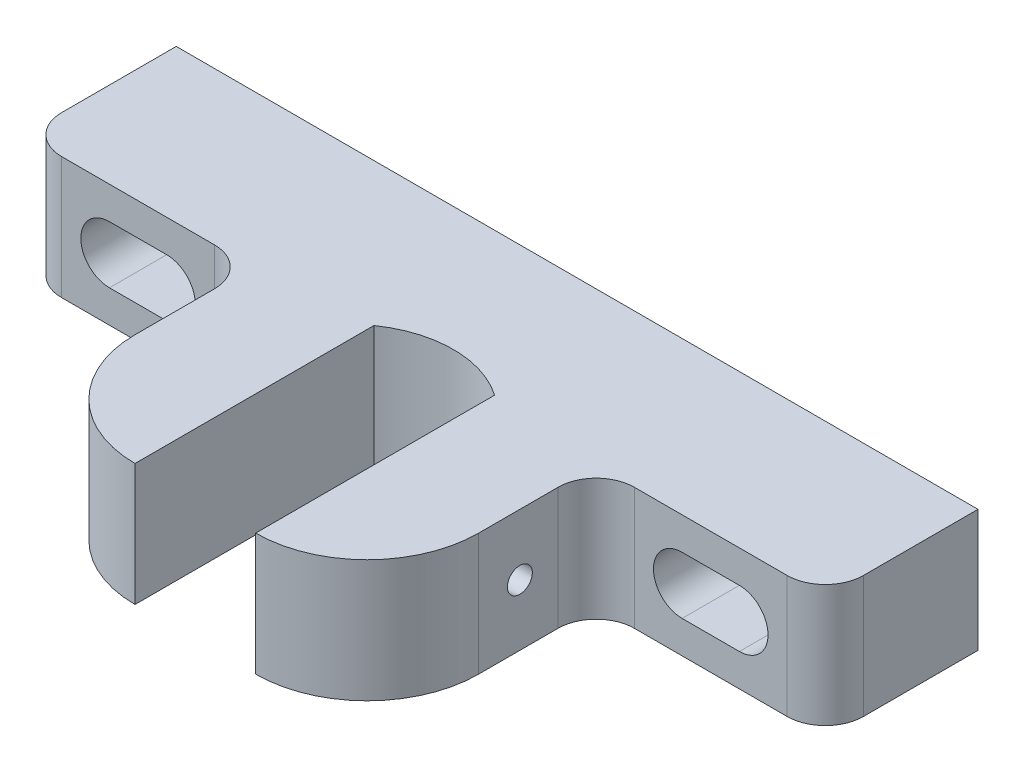
ISO-10303-21;
HEADER;
FILE_DESCRIPTION(('STEP AP214'),'2;1');
FILE_NAME('part.step','',(''),(''),'','','');
FILE_SCHEMA(('AUTOMOTIVE_DESIGN { 1 0 10303 214 1 1 1 1 }'));
ENDSEC;
DATA;
#1=APPLICATION_CONTEXT('core data for automotive mechanical design processes');
#2=APPLICATION_PROTOCOL_DEFINITION('international standard','automotive_design',2000,#1);
#3=PRODUCT_CONTEXT('',#1,'mechanical');
#4=PRODUCT('Part','Part','',(#3));
#5=PRODUCT_RELATED_PRODUCT_CATEGORY('part','',(#4));
#6=PRODUCT_DEFINITION_FORMATION('','',#4);
#7=PRODUCT_DEFINITION_CONTEXT('part definition',#1,'design');
#8=PRODUCT_DEFINITION('design','',#6,#7);
#9=PRODUCT_DEFINITION_SHAPE('','',#8);
#10=(LENGTH_UNIT() NAMED_UNIT(*) SI_UNIT(.MILLI.,.METRE.));
#11=(NAMED_UNIT(*) PLANE_ANGLE_UNIT() SI_UNIT($,.RADIAN.));
#12=(NAMED_UNIT(*) SI_UNIT($,.STERADIAN.) SOLID_ANGLE_UNIT());
#13=UNCERTAINTY_MEASURE_WITH_UNIT(LENGTH_MEASURE(1.E-05),#10,'distance_accuracy_value','');
#14=(GEOMETRIC_REPRESENTATION_CONTEXT(3) GLOBAL_UNCERTAINTY_ASSIGNED_CONTEXT((#13)) GLOBAL_UNIT_ASSIGNED_CONTEXT((#10,
#11,#12)) REPRESENTATION_CONTEXT('',''));
#15=CARTESIAN_POINT('',(0.,0.,0.));
#16=DIRECTION('',(0.,0.,1.));
#17=DIRECTION('',(1.,0.,0.));
#18=AXIS2_PLACEMENT_3D('',#15,#16,#17);
#19=CARTESIAN_POINT('',(28.5749999999999,24.2887500000001,44.958));
#20=DIRECTION('',(-1.,0.,0.));
#21=DIRECTION('',(0.,0.,1.));
#22=AXIS2_PLACEMENT_3D('',#19,#20,#21);
#23=PLANE('',#22);
#24=DIRECTION('',(0.,0.,-1.));
#25=VECTOR('',#24,1.);
#26=CARTESIAN_POINT('',(28.5749999999999,3.96875000000006,44.958));
#27=LINE('',#26,#25);
#28=CARTESIAN_POINT('',(28.5749999999999,3.96875000000006,44.958));
#29=VERTEX_POINT('',#28);
#30=CARTESIAN_POINT('',(28.5749999999999,3.96875000000006,31.75));
#31=VERTEX_POINT('',#30);
#32=EDGE_CURVE('E369',#29,#31,#27,.T.);
#33=ORIENTED_EDGE('',*,*,#32,.T.);
#34=DIRECTION('',(0.,-1.,0.));
#35=VECTOR('',#34,1.);
#36=CARTESIAN_POINT('',(28.5749999999999,24.2887500000001,31.75));
#37=LINE('',#36,#35);
#38=CARTESIAN_POINT('',(28.5749999999999,24.2887500000001,31.75));
#39=VERTEX_POINT('',#38);
#40=EDGE_CURVE('E419',#39,#31,#37,.T.);
#41=ORIENTED_EDGE('',*,*,#40,.F.);
#42=DIRECTION('',(0.,0.,-1.));
#43=VECTOR('',#42,1.);
#44=CARTESIAN_POINT('',(28.5749999999999,24.2887500000001,44.958));
#45=LINE('',#44,#43);
#46=CARTESIAN_POINT('',(28.5749999999999,24.2887500000001,44.958));
#47=VERTEX_POINT('',#46);
#48=EDGE_CURVE('E326',#47,#39,#45,.T.);
#49=ORIENTED_EDGE('',*,*,#48,.F.);
#50=DIRECTION('',(0.,-1.,0.));
#51=VECTOR('',#50,1.);
#52=CARTESIAN_POINT('',(28.5749999999999,24.2887500000001,44.958));
#53=LINE('',#52,#51);
#54=EDGE_CURVE('E422',#47,#29,#53,.T.);
#55=ORIENTED_EDGE('',*,*,#54,.T.);
#56=EDGE_LOOP('',(#33,#41,#49,#55));
#57=FACE_BOUND('',#56,.T.);
#58=CARTESIAN_POINT('',(28.5749999999999,14.1287500000001,38.1));
#59=DIRECTION('',(-1.,0.,0.));
#60=DIRECTION('',(0.,0.,1.));
#61=AXIS2_PLACEMENT_3D('',#58,#59,#60);
#62=CIRCLE('',#61,2.07645);
#63=CARTESIAN_POINT('',(28.5749999999999,14.1287500000001,40.17645));
#64=VERTEX_POINT('',#63);
#65=EDGE_CURVE('E726',#64,#64,#62,.F.);
#66=ORIENTED_EDGE('',*,*,#65,.F.);
#67=EDGE_LOOP('',(#66));
#68=FACE_BOUND('',#67,.T.);
#69=ADVANCED_FACE('F38',(#57,#68),#23,.F.);
#70=CARTESIAN_POINT('',(10.0329999999999,24.2887500000001,23.761628021285));
#71=DIRECTION('',(1.,0.,0.));
#72=DIRECTION('',(0.,0.,-1.));
#73=AXIS2_PLACEMENT_3D('',#70,#71,#72);
#74=PLANE('',#73);
#75=DIRECTION('',(0.,0.,1.));
#76=VECTOR('',#75,1.);
#77=CARTESIAN_POINT('',(10.0329999999999,3.96875000000006,23.761628021285));
#78=LINE('',#77,#76);
#79=CARTESIAN_POINT('',(10.0329999999999,3.96875000000006,23.761628021285));
#80=VERTEX_POINT('',#79);
#81=CARTESIAN_POINT('',(10.0329999999999,3.96875000000006,63.5));
#82=VERTEX_POINT('',#81);
#83=EDGE_CURVE('E361',#80,#82,#78,.T.);
#84=ORIENTED_EDGE('',*,*,#83,.T.);
#85=DIRECTION('',(0.,-1.,0.));
#86=VECTOR('',#85,1.);
#87=CARTESIAN_POINT('',(10.0329999999999,24.2887500000001,63.5));
#88=LINE('',#87,#86);
#89=CARTESIAN_POINT('',(10.0329999999999,24.2887500000001,63.5));
#90=VERTEX_POINT('',#89);
#91=EDGE_CURVE('E425',#90,#82,#88,.T.);
#92=ORIENTED_EDGE('',*,*,#91,.F.);
#93=DIRECTION('',(0.,0.,1.));
#94=VECTOR('',#93,1.);
#95=CARTESIAN_POINT('',(10.0329999999999,24.2887500000001,23.761628021285));
#96=LINE('',#95,#94);
#97=CARTESIAN_POINT('',(10.0329999999999,24.2887500000001,23.761628021285));
#98=VERTEX_POINT('',#97);
#99=EDGE_CURVE('E317',#98,#90,#96,.T.);
#100=ORIENTED_EDGE('',*,*,#99,.F.);
#101=DIRECTION('',(0.,-1.,0.));
#102=VECTOR('',#101,1.);
#103=CARTESIAN_POINT('',(10.0329999999999,24.2887500000001,23.761628021285));
#104=LINE('',#103,#102);
#105=EDGE_CURVE('E357',#98,#80,#104,.T.);
#106=ORIENTED_EDGE('',*,*,#105,.T.);
#107=EDGE_LOOP('',(#84,#92,#100,#106));
#108=FACE_BOUND('',#107,.T.);
#109=CARTESIAN_POINT('',(10.0329999999999,14.1287500000001,38.1));
#110=DIRECTION('',(1.,0.,0.));
#111=DIRECTION('',(0.,0.,-1.));
#112=AXIS2_PLACEMENT_3D('',#109,#110,#111);
#113=CIRCLE('',#112,2.07645);
#114=CARTESIAN_POINT('',(10.0329999999999,14.1287500000001,36.02355));
#115=VERTEX_POINT('',#114);
#116=EDGE_CURVE('E42',#115,#115,#113,.F.);
#117=ORIENTED_EDGE('',*,*,#116,.F.);
#118=EDGE_LOOP('',(#117));
#119=FACE_BOUND('',#118,.T.);
#120=ADVANCED_FACE('F528',(#108,#119),#74,.F.);
#121=CARTESIAN_POINT('',(-66.6749999999999,24.2887500000001,63.5));
#122=DIRECTION('',(1.,0.,0.));
#123=DIRECTION('',(0.,0.,-1.));
#124=AXIS2_PLACEMENT_3D('',#121,#122,#123);
#125=PLANE('',#124);
#126=DIRECTION('',(0.,0.,-1.));
#127=VECTOR('',#126,1.);
#128=CARTESIAN_POINT('',(-66.6749999999999,3.96875000000006,63.5));
#129=LINE('',#128,#127);
#130=CARTESIAN_POINT('',(-66.6749999999999,3.96875000000006,19.05));
#131=VERTEX_POINT('',#130);
#132=CARTESIAN_POINT('',(-66.6749999999999,3.96875000000006,0.));
#133=VERTEX_POINT('',#132);
#134=EDGE_CURVE('E454',#131,#133,#129,.T.);
#135=ORIENTED_EDGE('',*,*,#134,.F.);
#136=DIRECTION('',(0.,-1.,0.));
#137=VECTOR('',#136,1.);
#138=CARTESIAN_POINT('',(-66.6749999999999,24.2887500000001,19.05));
#139=LINE('',#138,#137);
#140=CARTESIAN_POINT('',(-66.6749999999999,24.2887500000001,19.05));
#141=VERTEX_POINT('',#140);
#142=EDGE_CURVE('E480',#131,#141,#139,.F.);
#143=ORIENTED_EDGE('',*,*,#142,.T.);
#144=DIRECTION('',(0.,0.,-1.));
#145=VECTOR('',#144,1.);
#146=CARTESIAN_POINT('',(-66.6749999999999,24.2887500000001,63.5));
#147=LINE('',#146,#145);
#148=CARTESIAN_POINT('',(-66.6749999999999,24.2887500000001,0.));
#149=VERTEX_POINT('',#148);
#150=EDGE_CURVE('E445',#141,#149,#147,.T.);
#151=ORIENTED_EDGE('',*,*,#150,.T.);
#152=DIRECTION('',(0.,-1.,0.));
#153=VECTOR('',#152,1.);
#154=CARTESIAN_POINT('',(-66.6749999999999,24.2887500000001,0.));
#155=LINE('',#154,#153);
#156=EDGE_CURVE('E402',#149,#133,#155,.T.);
#157=ORIENTED_EDGE('',*,*,#156,.T.);
#158=EDGE_LOOP('',(#135,#143,#151,#157));
#159=FACE_BOUND('',#158,.T.);
#160=ADVANCED_FACE('F534',(#159),#125,.F.);
#161=CARTESIAN_POINT('',(-66.6749999999999,3.96875000000006,63.5));
#162=DIRECTION('',(0.,1.,0.));
#163=DIRECTION('',(0.,0.,1.));
#164=AXIS2_PLACEMENT_3D('',#161,#162,#163);
#165=PLANE('',#164);
#166=DIRECTION('',(0.,0.,-1.));
#167=VECTOR('',#166,1.);
#168=CARTESIAN_POINT('',(66.6750000000001,3.96875000000006,63.5));
#169=LINE('',#168,#167);
#170=CARTESIAN_POINT('',(66.6750000000001,3.96875000000006,19.05));
#171=VERTEX_POINT('',#170);
#172=CARTESIAN_POINT('',(66.6750000000001,3.96875000000006,0.));
#173=VERTEX_POINT('',#172);
#174=EDGE_CURVE('E451',#171,#173,#169,.T.);
#175=ORIENTED_EDGE('',*,*,#174,.F.);
#176=CARTESIAN_POINT('',(60.3250000000001,3.96875000000006,19.05));
#177=DIRECTION('',(0.,1.,0.));
#178=DIRECTION('',(0.,0.,1.));
#179=AXIS2_PLACEMENT_3D('',#176,#177,#178);
#180=CIRCLE('',#179,6.35);
#181=CARTESIAN_POINT('',(60.3250000000001,3.96875000000006,25.4));
#182=VERTEX_POINT('',#181);
#183=EDGE_CURVE('E464',#171,#182,#180,.F.);
#184=ORIENTED_EDGE('',*,*,#183,.T.);
#185=DIRECTION('',(1.,0.,0.));
#186=VECTOR('',#185,1.);
#187=CARTESIAN_POINT('',(66.6749999999999,3.96875000000006,25.4));
#188=LINE('',#187,#186);
#189=CARTESIAN_POINT('',(34.9249999999999,3.96875000000006,25.4));
#190=VERTEX_POINT('',#189);
#191=EDGE_CURVE('E377',#190,#182,#188,.T.);
#192=ORIENTED_EDGE('',*,*,#191,.F.);
#193=CARTESIAN_POINT('',(34.9249999999999,3.96875000000006,31.75));
#194=DIRECTION('',(0.,-1.,0.));
#195=DIRECTION('',(0.,0.,1.));
#196=AXIS2_PLACEMENT_3D('',#193,#194,#195);
#197=CIRCLE('',#196,6.35);
#198=EDGE_CURVE('E373',#31,#190,#197,.T.);
#199=ORIENTED_EDGE('',*,*,#198,.F.);
#200=ORIENTED_EDGE('',*,*,#32,.F.);
#201=CARTESIAN_POINT('',(10.0329999999999,3.96875000000006,44.958));
#202=DIRECTION('',(0.,1.,0.));
#203=DIRECTION('',(0.,0.,1.));
#204=AXIS2_PLACEMENT_3D('',#201,#202,#203);
#205=CIRCLE('',#204,18.542);
#206=EDGE_CURVE('E365',#82,#29,#205,.T.);
#207=ORIENTED_EDGE('',*,*,#206,.F.);
#208=ORIENTED_EDGE('',*,*,#83,.F.);
#209=CARTESIAN_POINT('',(0.,3.96875000000006,38.0999999999986));
#210=DIRECTION('',(0.,-1.,0.));
#211=DIRECTION('',(0.,0.,1.));
#212=AXIS2_PLACEMENT_3D('',#209,#210,#211);
#213=CIRCLE('',#212,17.4999999999988);
#214=CARTESIAN_POINT('',(-10.0329999999999,3.96875000000006,23.761628021285));
#215=VERTEX_POINT('',#214);
#216=EDGE_CURVE('E303',#215,#80,#213,.T.);
#217=ORIENTED_EDGE('',*,*,#216,.F.);
#218=DIRECTION('',(0.,0.,-1.));
#219=VECTOR('',#218,1.);
#220=CARTESIAN_POINT('',(-10.0329999999999,3.96875000000006,23.761628021285));
#221=LINE('',#220,#219);
#222=CARTESIAN_POINT('',(-10.0329999999999,3.96875000000006,63.5));
#223=VERTEX_POINT('',#222);
#224=EDGE_CURVE('E318',#223,#215,#221,.T.);
#225=ORIENTED_EDGE('',*,*,#224,.F.);
#226=CARTESIAN_POINT('',(-10.0329999999999,3.96875000000006,44.958));
#227=DIRECTION('',(0.,1.,0.));
#228=DIRECTION('',(0.,0.,-1.));
#229=AXIS2_PLACEMENT_3D('',#226,#227,#228);
#230=CIRCLE('',#229,18.542);
#231=CARTESIAN_POINT('',(-28.5749999999999,3.96875000000006,44.958));
#232=VERTEX_POINT('',#231);
#233=EDGE_CURVE('E392',#232,#223,#230,.T.);
#234=ORIENTED_EDGE('',*,*,#233,.F.);
#235=DIRECTION('',(0.,0.,1.));
#236=VECTOR('',#235,1.);
#237=CARTESIAN_POINT('',(-28.5749999999999,3.96875000000006,44.958));
#238=LINE('',#237,#236);
#239=CARTESIAN_POINT('',(-28.5749999999999,3.96875000000006,31.75));
#240=VERTEX_POINT('',#239);
#241=EDGE_CURVE('E388',#240,#232,#238,.T.);
#242=ORIENTED_EDGE('',*,*,#241,.F.);
#243=CARTESIAN_POINT('',(-34.9249999999999,3.96875000000006,31.75));
#244=DIRECTION('',(0.,-1.,0.));
#245=DIRECTION('',(0.,0.,-1.));
#246=AXIS2_PLACEMENT_3D('',#243,#244,#245);
#247=CIRCLE('',#246,6.35);
#248=CARTESIAN_POINT('',(-34.9249999999999,3.96875000000006,25.4));
#249=VERTEX_POINT('',#248);
#250=EDGE_CURVE('E384',#249,#240,#247,.T.);
#251=ORIENTED_EDGE('',*,*,#250,.F.);
#252=DIRECTION('',(1.,0.,0.));
#253=VECTOR('',#252,1.);
#254=CARTESIAN_POINT('',(-66.6749999999999,3.96875000000006,25.4));
#255=LINE('',#254,#253);
#256=CARTESIAN_POINT('',(-60.3249999999999,3.96875000000006,25.4));
#257=VERTEX_POINT('',#256);
#258=EDGE_CURVE('E381',#257,#249,#255,.T.);
#259=ORIENTED_EDGE('',*,*,#258,.F.);
#260=CARTESIAN_POINT('',(-60.3249999999999,3.96875000000006,19.05));
#261=DIRECTION('',(0.,1.,0.));
#262=DIRECTION('',(0.,0.,1.));
#263=AXIS2_PLACEMENT_3D('',#260,#261,#262);
#264=CIRCLE('',#263,6.35);
#265=EDGE_CURVE('E461',#257,#131,#264,.F.);
#266=ORIENTED_EDGE('',*,*,#265,.T.);
#267=ORIENTED_EDGE('',*,*,#134,.T.);
#268=DIRECTION('',(1.,0.,0.));
#269=VECTOR('',#268,1.);
#270=CARTESIAN_POINT('',(-66.6749999999999,3.96875000000006,0.));
#271=LINE('',#270,#269);
#272=EDGE_CURVE('E433',#133,#173,#271,.T.);
#273=ORIENTED_EDGE('',*,*,#272,.T.);
#274=EDGE_LOOP('',(#175,#184,#192,#199,#200,#207,#208,#217,#225,#234,#242,#251,#259,#266,#267,#273));
#275=FACE_BOUND('',#274,.T.);
#276=ADVANCED_FACE('F561',(#275),#165,.F.);
#277=CARTESIAN_POINT('',(66.6750000000001,24.2887500000001,63.5));
#278=DIRECTION('',(-1.,0.,0.));
#279=DIRECTION('',(0.,0.,1.));
#280=AXIS2_PLACEMENT_3D('',#277,#278,#279);
#281=PLANE('',#280);
#282=DIRECTION('',(0.,0.,-1.));
#283=VECTOR('',#282,1.);
#284=CARTESIAN_POINT('',(66.6750000000001,24.2887500000001,63.5));
#285=LINE('',#284,#283);
#286=CARTESIAN_POINT('',(66.6750000000001,24.2887500000001,19.05));
#287=VERTEX_POINT('',#286);
#288=CARTESIAN_POINT('',(66.6750000000001,24.2887500000001,0.));
#289=VERTEX_POINT('',#288);
#290=EDGE_CURVE('E448',#287,#289,#285,.T.);
#291=ORIENTED_EDGE('',*,*,#290,.F.);
#292=DIRECTION('',(0.,-1.,0.));
#293=VECTOR('',#292,1.);
#294=CARTESIAN_POINT('',(66.6750000000001,24.2887500000001,19.05));
#295=LINE('',#294,#293);
#296=EDGE_CURVE('E457',#287,#171,#295,.T.);
#297=ORIENTED_EDGE('',*,*,#296,.T.);
#298=ORIENTED_EDGE('',*,*,#174,.T.);
#299=DIRECTION('',(0.,1.,0.));
#300=VECTOR('',#299,1.);
#301=CARTESIAN_POINT('',(66.6750000000001,24.2887500000001,0.));
#302=LINE('',#301,#300);
#303=EDGE_CURVE('E437',#173,#289,#302,.T.);
#304=ORIENTED_EDGE('',*,*,#303,.T.);
#305=EDGE_LOOP('',(#291,#297,#298,#304));
#306=FACE_BOUND('',#305,.T.);
#307=ADVANCED_FACE('F557',(#306),#281,.F.);
#308=CARTESIAN_POINT('',(-66.6749999999999,24.2887500000001,63.5));
#309=DIRECTION('',(0.,-1.,0.));
#310=DIRECTION('',(0.,0.,-1.));
#311=AXIS2_PLACEMENT_3D('',#308,#309,#310);
#312=PLANE('',#311);
#313=DIRECTION('',(1.,0.,0.));
#314=VECTOR('',#313,1.);
#315=CARTESIAN_POINT('',(66.6749999999999,24.2887500000001,25.4));
#316=LINE('',#315,#314);
#317=CARTESIAN_POINT('',(34.9249999999999,24.2887500000001,25.4));
#318=VERTEX_POINT('',#317);
#319=CARTESIAN_POINT('',(60.3250000000001,24.2887500000001,25.4));
#320=VERTEX_POINT('',#319);
#321=EDGE_CURVE('E334',#318,#320,#316,.T.);
#322=ORIENTED_EDGE('',*,*,#321,.T.);
#323=CARTESIAN_POINT('',(60.3250000000001,24.2887500000001,19.05));
#324=DIRECTION('',(0.,-1.,0.));
#325=DIRECTION('',(0.,0.,-1.));
#326=AXIS2_PLACEMENT_3D('',#323,#324,#325);
#327=CIRCLE('',#326,6.35);
#328=EDGE_CURVE('E473',#320,#287,#327,.F.);
#329=ORIENTED_EDGE('',*,*,#328,.T.);
#330=ORIENTED_EDGE('',*,*,#290,.T.);
#331=DIRECTION('',(-1.,0.,0.));
#332=VECTOR('',#331,1.);
#333=CARTESIAN_POINT('',(-66.6749999999999,24.2887500000001,0.));
#334=LINE('',#333,#332);
#335=EDGE_CURVE('E441',#289,#149,#334,.T.);
#336=ORIENTED_EDGE('',*,*,#335,.T.);
#337=ORIENTED_EDGE('',*,*,#150,.F.);
#338=CARTESIAN_POINT('',(-60.3249999999999,24.2887500000001,19.05));
#339=DIRECTION('',(0.,-1.,0.));
#340=DIRECTION('',(0.,0.,-1.));
#341=AXIS2_PLACEMENT_3D('',#338,#339,#340);
#342=CIRCLE('',#341,6.35);
#343=CARTESIAN_POINT('',(-60.3249999999999,24.2887500000001,25.4));
#344=VERTEX_POINT('',#343);
#345=EDGE_CURVE('E470',#141,#344,#342,.F.);
#346=ORIENTED_EDGE('',*,*,#345,.T.);
#347=DIRECTION('',(1.,0.,0.));
#348=VECTOR('',#347,1.);
#349=CARTESIAN_POINT('',(-66.6749999999999,24.2887500000001,25.4));
#350=LINE('',#349,#348);
#351=CARTESIAN_POINT('',(-34.9249999999999,24.2887500000001,25.4));
#352=VERTEX_POINT('',#351);
#353=EDGE_CURVE('E338',#344,#352,#350,.T.);
#354=ORIENTED_EDGE('',*,*,#353,.T.);
#355=CARTESIAN_POINT('',(-34.9249999999999,24.2887500000001,31.75));
#356=DIRECTION('',(0.,-1.,0.));
#357=DIRECTION('',(0.,0.,-1.));
#358=AXIS2_PLACEMENT_3D('',#355,#356,#357);
#359=CIRCLE('',#358,6.35);
#360=CARTESIAN_POINT('',(-28.5749999999999,24.2887500000001,31.75));
#361=VERTEX_POINT('',#360);
#362=EDGE_CURVE('E341',#352,#361,#359,.T.);
#363=ORIENTED_EDGE('',*,*,#362,.T.);
#364=DIRECTION('',(0.,0.,1.));
#365=VECTOR('',#364,1.);
#366=CARTESIAN_POINT('',(-28.5749999999999,24.2887500000001,44.958));
#367=LINE('',#366,#365);
#368=CARTESIAN_POINT('',(-28.5749999999999,24.2887500000001,44.958));
#369=VERTEX_POINT('',#368);
#370=EDGE_CURVE('E345',#361,#369,#367,.T.);
#371=ORIENTED_EDGE('',*,*,#370,.T.);
#372=CARTESIAN_POINT('',(-10.0329999999999,24.2887500000001,44.958));
#373=DIRECTION('',(0.,1.,0.));
#374=DIRECTION('',(0.,0.,-1.));
#375=AXIS2_PLACEMENT_3D('',#372,#373,#374);
#376=CIRCLE('',#375,18.542);
#377=CARTESIAN_POINT('',(-10.0329999999999,24.2887500000001,63.5));
#378=VERTEX_POINT('',#377);
#379=EDGE_CURVE('E349',#369,#378,#376,.T.);
#380=ORIENTED_EDGE('',*,*,#379,.T.);
#381=DIRECTION('',(0.,0.,-1.));
#382=VECTOR('',#381,1.);
#383=CARTESIAN_POINT('',(-10.0329999999999,24.2887500000001,23.761628021285));
#384=LINE('',#383,#382);
#385=CARTESIAN_POINT('',(-10.0329999999999,24.2887500000001,23.761628021285));
#386=VERTEX_POINT('',#385);
#387=EDGE_CURVE('E353',#378,#386,#384,.T.);
#388=ORIENTED_EDGE('',*,*,#387,.T.);
#389=CARTESIAN_POINT('',(0.,24.2887500000001,38.0999999999986));
#390=DIRECTION('',(0.,-1.,0.));
#391=DIRECTION('',(0.,0.,1.));
#392=AXIS2_PLACEMENT_3D('',#389,#390,#391);
#393=CIRCLE('',#392,17.4999999999988);
#394=EDGE_CURVE('E313',#386,#98,#393,.T.);
#395=ORIENTED_EDGE('',*,*,#394,.T.);
#396=ORIENTED_EDGE('',*,*,#99,.T.);
#397=CARTESIAN_POINT('',(10.0329999999999,24.2887500000001,44.958));
#398=DIRECTION('',(0.,1.,0.));
#399=DIRECTION('',(0.,0.,1.));
#400=AXIS2_PLACEMENT_3D('',#397,#398,#399);
#401=CIRCLE('',#400,18.542);
#402=EDGE_CURVE('E322',#90,#47,#401,.T.);
#403=ORIENTED_EDGE('',*,*,#402,.T.);
#404=ORIENTED_EDGE('',*,*,#48,.T.);
#405=CARTESIAN_POINT('',(34.9249999999999,24.2887500000001,31.75));
#406=DIRECTION('',(0.,-1.,0.));
#407=DIRECTION('',(0.,0.,1.));
#408=AXIS2_PLACEMENT_3D('',#405,#406,#407);
#409=CIRCLE('',#408,6.35);
#410=EDGE_CURVE('E330',#39,#318,#409,.T.);
#411=ORIENTED_EDGE('',*,*,#410,.T.);
#412=EDGE_LOOP('',(#322,#329,#330,#336,#337,#346,#354,#363,#371,#380,#388,#395,#396,#403,#404,#411));
#413=FACE_BOUND('',#412,.T.);
#414=ADVANCED_FACE('F554',(#413),#312,.F.);
#415=CARTESIAN_POINT('',(-66.6749999999999,3.96875000000006,0.));
#416=DIRECTION('',(0.,0.,1.));
#417=DIRECTION('',(1.,0.,0.));
#418=AXIS2_PLACEMENT_3D('',#415,#416,#417);
#419=PLANE('',#418);
#420=DIRECTION('',(1.,0.,0.));
#421=VECTOR('',#420,1.);
#422=CARTESIAN_POINT('',(-52.3875,18.8912500000001,0.));
#423=LINE('',#422,#421);
#424=CARTESIAN_POINT('',(-52.3875,18.8912500000001,0.));
#425=VERTEX_POINT('',#424);
#426=CARTESIAN_POINT('',(-42.8625,18.8912500000001,0.));
#427=VERTEX_POINT('',#426);
#428=EDGE_CURVE('E262',#425,#427,#423,.T.);
#429=ORIENTED_EDGE('',*,*,#428,.F.);
#430=CARTESIAN_POINT('',(-52.3875,14.1287500000001,0.));
#431=DIRECTION('',(0.,0.,-1.));
#432=DIRECTION('',(-1.,0.,0.));
#433=AXIS2_PLACEMENT_3D('',#430,#431,#432);
#434=CIRCLE('',#433,4.7625);
#435=CARTESIAN_POINT('',(-52.3875,9.36625000000008,0.));
#436=VERTEX_POINT('',#435);
#437=EDGE_CURVE('E58',#436,#425,#434,.T.);
#438=ORIENTED_EDGE('',*,*,#437,.F.);
#439=DIRECTION('',(-1.,0.,0.));
#440=VECTOR('',#439,1.);
#441=CARTESIAN_POINT('',(-52.3875,9.36625000000008,0.));
#442=LINE('',#441,#440);
#443=CARTESIAN_POINT('',(-42.8625,9.36625000000008,0.));
#444=VERTEX_POINT('',#443);
#445=EDGE_CURVE('E270',#444,#436,#442,.T.);
#446=ORIENTED_EDGE('',*,*,#445,.F.);
#447=CARTESIAN_POINT('',(-42.8625,14.1287500000001,0.));
#448=DIRECTION('',(0.,0.,-1.));
#449=DIRECTION('',(-1.,0.,0.));
#450=AXIS2_PLACEMENT_3D('',#447,#448,#449);
#451=CIRCLE('',#450,4.7625);
#452=EDGE_CURVE('E252',#427,#444,#451,.T.);
#453=ORIENTED_EDGE('',*,*,#452,.F.);
#454=EDGE_LOOP('',(#429,#438,#446,#453));
#455=FACE_BOUND('',#454,.T.);
#456=DIRECTION('',(-1.,0.,0.));
#457=VECTOR('',#456,1.);
#458=CARTESIAN_POINT('',(52.3875,9.36625000000008,0.));
#459=LINE('',#458,#457);
#460=CARTESIAN_POINT('',(52.3875,9.36625000000008,0.));
#461=VERTEX_POINT('',#460);
#462=CARTESIAN_POINT('',(42.8625,9.36625000000007,0.));
#463=VERTEX_POINT('',#462);
#464=EDGE_CURVE('E287',#461,#463,#459,.T.);
#465=ORIENTED_EDGE('',*,*,#464,.F.);
#466=CARTESIAN_POINT('',(52.3875,14.1287500000001,0.));
#467=DIRECTION('',(0.,0.,-1.));
#468=DIRECTION('',(1.,0.,0.));
#469=AXIS2_PLACEMENT_3D('',#466,#467,#468);
#470=CIRCLE('',#469,4.7625);
#471=CARTESIAN_POINT('',(52.3875,18.8912500000001,0.));
#472=VERTEX_POINT('',#471);
#473=EDGE_CURVE('E281',#472,#461,#470,.T.);
#474=ORIENTED_EDGE('',*,*,#473,.F.);
#475=DIRECTION('',(1.,0.,0.));
#476=VECTOR('',#475,1.);
#477=CARTESIAN_POINT('',(52.3875,18.8912500000001,0.));
#478=LINE('',#477,#476);
#479=CARTESIAN_POINT('',(42.8625,18.8912500000001,0.));
#480=VERTEX_POINT('',#479);
#481=EDGE_CURVE('E295',#480,#472,#478,.T.);
#482=ORIENTED_EDGE('',*,*,#481,.F.);
#483=CARTESIAN_POINT('',(42.8625,14.1287500000001,0.));
#484=DIRECTION('',(0.,0.,-1.));
#485=DIRECTION('',(1.,0.,0.));
#486=AXIS2_PLACEMENT_3D('',#483,#484,#485);
#487=CIRCLE('',#486,4.7625);
#488=EDGE_CURVE('E291',#463,#480,#487,.T.);
#489=ORIENTED_EDGE('',*,*,#488,.F.);
#490=EDGE_LOOP('',(#465,#474,#482,#489));
#491=FACE_BOUND('',#490,.T.);
#492=ORIENTED_EDGE('',*,*,#156,.F.);
#493=ORIENTED_EDGE('',*,*,#335,.F.);
#494=ORIENTED_EDGE('',*,*,#303,.F.);
#495=ORIENTED_EDGE('',*,*,#272,.F.);
#496=EDGE_LOOP('',(#492,#493,#494,#495));
#497=FACE_BOUND('',#496,.T.);
#498=ADVANCED_FACE('F267',(#455,#491,#497),#419,.F.);
#499=CARTESIAN_POINT('',(0.,24.2887500000001,38.0999999999986));
#500=DIRECTION('',(0.,-1.,0.));
#501=DIRECTION('',(0.,0.,-1.));
#502=AXIS2_PLACEMENT_3D('',#499,#500,#501);
#503=CYLINDRICAL_SURFACE('',#502,17.4999999999988);
#504=ORIENTED_EDGE('',*,*,#216,.T.);
#505=ORIENTED_EDGE('',*,*,#105,.F.);
#506=ORIENTED_EDGE('',*,*,#394,.F.);
#507=DIRECTION('',(0.,-1.,0.));
#508=VECTOR('',#507,1.);
#509=CARTESIAN_POINT('',(-10.0329999999999,24.2887500000001,23.761628021285));
#510=LINE('',#509,#508);
#511=EDGE_CURVE('E399',#386,#215,#510,.T.);
#512=ORIENTED_EDGE('',*,*,#511,.T.);
#513=EDGE_LOOP('',(#504,#505,#506,#512));
#514=FACE_BOUND('',#513,.T.);
#515=ADVANCED_FACE('F547',(#514),#503,.F.);
#516=CARTESIAN_POINT('',(-10.0329999999999,24.2887500000001,23.761628021285));
#517=DIRECTION('',(-1.,0.,0.));
#518=DIRECTION('',(0.,0.,1.));
#519=AXIS2_PLACEMENT_3D('',#516,#517,#518);
#520=PLANE('',#519);
#521=ORIENTED_EDGE('',*,*,#224,.T.);
#522=ORIENTED_EDGE('',*,*,#511,.F.);
#523=ORIENTED_EDGE('',*,*,#387,.F.);
#524=DIRECTION('',(0.,-1.,0.));
#525=VECTOR('',#524,1.);
#526=CARTESIAN_POINT('',(-10.0329999999999,24.2887500000001,63.5));
#527=LINE('',#526,#525);
#528=EDGE_CURVE('E403',#378,#223,#527,.T.);
#529=ORIENTED_EDGE('',*,*,#528,.T.);
#530=EDGE_LOOP('',(#521,#522,#523,#529));
#531=FACE_BOUND('',#530,.T.);
#532=ADVANCED_FACE('F550',(#531),#520,.F.);
#533=CARTESIAN_POINT('',(-10.0329999999999,24.2887500000001,44.958));
#534=DIRECTION('',(0.,-1.,0.));
#535=DIRECTION('',(0.,0.,-1.));
#536=AXIS2_PLACEMENT_3D('',#533,#534,#535);
#537=CYLINDRICAL_SURFACE('',#536,18.542);
#538=ORIENTED_EDGE('',*,*,#233,.T.);
#539=ORIENTED_EDGE('',*,*,#528,.F.);
#540=ORIENTED_EDGE('',*,*,#379,.F.);
#541=DIRECTION('',(0.,-1.,0.));
#542=VECTOR('',#541,1.);
#543=CARTESIAN_POINT('',(-28.5749999999999,24.2887500000001,44.958));
#544=LINE('',#543,#542);
#545=EDGE_CURVE('E406',#369,#232,#544,.T.);
#546=ORIENTED_EDGE('',*,*,#545,.T.);
#547=EDGE_LOOP('',(#538,#539,#540,#546));
#548=FACE_BOUND('',#547,.T.);
#549=ADVANCED_FACE('F605',(#548),#537,.T.);
#550=CARTESIAN_POINT('',(-28.5749999999999,24.2887500000001,44.958));
#551=DIRECTION('',(1.,0.,0.));
#552=DIRECTION('',(0.,0.,-1.));
#553=AXIS2_PLACEMENT_3D('',#550,#551,#552);
#554=PLANE('',#553);
#555=ORIENTED_EDGE('',*,*,#241,.T.);
#556=ORIENTED_EDGE('',*,*,#545,.F.);
#557=ORIENTED_EDGE('',*,*,#370,.F.);
#558=DIRECTION('',(0.,-1.,0.));
#559=VECTOR('',#558,1.);
#560=CARTESIAN_POINT('',(-28.5749999999999,24.2887500000001,31.75));
#561=LINE('',#560,#559);
#562=EDGE_CURVE('E409',#361,#240,#561,.T.);
#563=ORIENTED_EDGE('',*,*,#562,.T.);
#564=EDGE_LOOP('',(#555,#556,#557,#563));
#565=FACE_BOUND('',#564,.T.);
#566=ADVANCED_FACE('F603',(#565),#554,.F.);
#567=CARTESIAN_POINT('',(-34.9249999999999,24.2887500000001,31.75));
#568=DIRECTION('',(0.,-1.,0.));
#569=DIRECTION('',(0.,0.,-1.));
#570=AXIS2_PLACEMENT_3D('',#567,#568,#569);
#571=CYLINDRICAL_SURFACE('',#570,6.35);
#572=ORIENTED_EDGE('',*,*,#250,.T.);
#573=ORIENTED_EDGE('',*,*,#562,.F.);
#574=ORIENTED_EDGE('',*,*,#362,.F.);
#575=DIRECTION('',(0.,-1.,0.));
#576=VECTOR('',#575,1.);
#577=CARTESIAN_POINT('',(-34.9249999999999,24.2887500000001,25.4));
#578=LINE('',#577,#576);
#579=EDGE_CURVE('E412',#352,#249,#578,.T.);
#580=ORIENTED_EDGE('',*,*,#579,.T.);
#581=EDGE_LOOP('',(#572,#573,#574,#580));
#582=FACE_BOUND('',#581,.T.);
#583=ADVANCED_FACE('F598',(#582),#571,.F.);
#584=CARTESIAN_POINT('',(-66.6749999999999,24.2887500000001,25.4));
#585=DIRECTION('',(0.,0.,-1.));
#586=DIRECTION('',(-1.,0.,0.));
#587=AXIS2_PLACEMENT_3D('',#584,#585,#586);
#588=PLANE('',#587);
#589=DIRECTION('',(-1.,0.,0.));
#590=VECTOR('',#589,1.);
#591=CARTESIAN_POINT('',(-66.6749999999999,9.36625000000008,25.4));
#592=LINE('',#591,#590);
#593=CARTESIAN_POINT('',(-42.8625,9.36625000000008,25.4));
#594=VERTEX_POINT('',#593);
#595=CARTESIAN_POINT('',(-52.3875,9.36625000000008,25.4));
#596=VERTEX_POINT('',#595);
#597=EDGE_CURVE('E48',#594,#596,#592,.T.);
#598=ORIENTED_EDGE('',*,*,#597,.T.);
#599=CARTESIAN_POINT('',(-52.3875,14.1287500000001,25.4));
#600=DIRECTION('',(0.,0.,-1.));
#601=DIRECTION('',(-1.,0.,0.));
#602=AXIS2_PLACEMENT_3D('',#599,#600,#601);
#603=CIRCLE('',#602,4.7625);
#604=CARTESIAN_POINT('',(-52.3875,18.8912500000001,25.4));
#605=VERTEX_POINT('',#604);
#606=EDGE_CURVE('E11',#596,#605,#603,.T.);
#607=ORIENTED_EDGE('',*,*,#606,.T.);
#608=DIRECTION('',(1.,0.,0.));
#609=VECTOR('',#608,1.);
#610=CARTESIAN_POINT('',(-66.6749999999999,18.8912500000001,25.4));
#611=LINE('',#610,#609);
#612=CARTESIAN_POINT('',(-42.8625,18.8912500000001,25.4));
#613=VERTEX_POINT('',#612);
#614=EDGE_CURVE('E499',#605,#613,#611,.T.);
#615=ORIENTED_EDGE('',*,*,#614,.T.);
#616=CARTESIAN_POINT('',(-42.8625,14.1287500000001,25.4));
#617=DIRECTION('',(0.,0.,-1.));
#618=DIRECTION('',(-1.,0.,0.));
#619=AXIS2_PLACEMENT_3D('',#616,#617,#618);
#620=CIRCLE('',#619,4.7625);
#621=EDGE_CURVE('E255',#613,#594,#620,.T.);
#622=ORIENTED_EDGE('',*,*,#621,.T.);
#623=EDGE_LOOP('',(#598,#607,#615,#622));
#624=FACE_BOUND('',#623,.T.);
#625=ORIENTED_EDGE('',*,*,#353,.F.);
#626=DIRECTION('',(0.,-1.,0.));
#627=VECTOR('',#626,1.);
#628=CARTESIAN_POINT('',(-60.3249999999999,24.2887500000001,25.4));
#629=LINE('',#628,#627);
#630=EDGE_CURVE('E476',#344,#257,#629,.T.);
#631=ORIENTED_EDGE('',*,*,#630,.T.);
#632=ORIENTED_EDGE('',*,*,#258,.T.);
#633=ORIENTED_EDGE('',*,*,#579,.F.);
#634=EDGE_LOOP('',(#625,#631,#632,#633));
#635=FACE_BOUND('',#634,.T.);
#636=ADVANCED_FACE('F508',(#624,#635),#588,.F.);
#637=CARTESIAN_POINT('',(66.6749999999999,24.2887500000001,25.4));
#638=DIRECTION('',(0.,0.,-1.));
#639=DIRECTION('',(-1.,0.,0.));
#640=AXIS2_PLACEMENT_3D('',#637,#638,#639);
#641=PLANE('',#640);
#642=DIRECTION('',(1.,0.,0.));
#643=VECTOR('',#642,1.);
#644=CARTESIAN_POINT('',(66.6749999999999,18.8912500000001,25.4));
#645=LINE('',#644,#643);
#646=CARTESIAN_POINT('',(42.8625,18.8912500000001,25.4));
#647=VERTEX_POINT('',#646);
#648=CARTESIAN_POINT('',(52.3875,18.8912500000001,25.4));
#649=VERTEX_POINT('',#648);
#650=EDGE_CURVE('E491',#647,#649,#645,.T.);
#651=ORIENTED_EDGE('',*,*,#650,.T.);
#652=CARTESIAN_POINT('',(52.3875,14.1287500000001,25.4));
#653=DIRECTION('',(0.,0.,-1.));
#654=DIRECTION('',(-1.,0.,0.));
#655=AXIS2_PLACEMENT_3D('',#652,#653,#654);
#656=CIRCLE('',#655,4.7625);
#657=CARTESIAN_POINT('',(52.3875,9.36625000000008,25.4));
#658=VERTEX_POINT('',#657);
#659=EDGE_CURVE('E495',#649,#658,#656,.T.);
#660=ORIENTED_EDGE('',*,*,#659,.T.);
#661=DIRECTION('',(-1.,0.,0.));
#662=VECTOR('',#661,1.);
#663=CARTESIAN_POINT('',(66.6749999999999,9.36625000000008,25.4));
#664=LINE('',#663,#662);
#665=CARTESIAN_POINT('',(42.8625,9.36625000000008,25.4));
#666=VERTEX_POINT('',#665);
#667=EDGE_CURVE('E483',#658,#666,#664,.T.);
#668=ORIENTED_EDGE('',*,*,#667,.T.);
#669=CARTESIAN_POINT('',(42.8625,14.1287500000001,25.4));
#670=DIRECTION('',(0.,0.,-1.));
#671=DIRECTION('',(-1.,0.,0.));
#672=AXIS2_PLACEMENT_3D('',#669,#670,#671);
#673=CIRCLE('',#672,4.7625);
#674=EDGE_CURVE('E487',#666,#647,#673,.T.);
#675=ORIENTED_EDGE('',*,*,#674,.T.);
#676=EDGE_LOOP('',(#651,#660,#668,#675));
#677=FACE_BOUND('',#676,.T.);
#678=ORIENTED_EDGE('',*,*,#191,.T.);
#679=DIRECTION('',(0.,-1.,0.));
#680=VECTOR('',#679,1.);
#681=CARTESIAN_POINT('',(60.3250000000001,24.2887500000001,25.4));
#682=LINE('',#681,#680);
#683=EDGE_CURVE('E467',#182,#320,#682,.F.);
#684=ORIENTED_EDGE('',*,*,#683,.T.);
#685=ORIENTED_EDGE('',*,*,#321,.F.);
#686=DIRECTION('',(0.,-1.,0.));
#687=VECTOR('',#686,1.);
#688=CARTESIAN_POINT('',(34.9249999999999,24.2887500000001,25.4));
#689=LINE('',#688,#687);
#690=EDGE_CURVE('E416',#318,#190,#689,.T.);
#691=ORIENTED_EDGE('',*,*,#690,.T.);
#692=EDGE_LOOP('',(#678,#684,#685,#691));
#693=FACE_BOUND('',#692,.T.);
#694=ADVANCED_FACE('F623',(#677,#693),#641,.F.);
#695=CARTESIAN_POINT('',(34.9249999999999,24.2887500000001,31.75));
#696=DIRECTION('',(0.,-1.,0.));
#697=DIRECTION('',(0.,0.,-1.));
#698=AXIS2_PLACEMENT_3D('',#695,#696,#697);
#699=CYLINDRICAL_SURFACE('',#698,6.35);
#700=ORIENTED_EDGE('',*,*,#198,.T.);
#701=ORIENTED_EDGE('',*,*,#690,.F.);
#702=ORIENTED_EDGE('',*,*,#410,.F.);
#703=ORIENTED_EDGE('',*,*,#40,.T.);
#704=EDGE_LOOP('',(#700,#701,#702,#703));
#705=FACE_BOUND('',#704,.T.);
#706=ADVANCED_FACE('F540',(#705),#699,.F.);
#707=CARTESIAN_POINT('',(10.0329999999999,24.2887500000001,44.958));
#708=DIRECTION('',(0.,-1.,0.));
#709=DIRECTION('',(0.,0.,-1.));
#710=AXIS2_PLACEMENT_3D('',#707,#708,#709);
#711=CYLINDRICAL_SURFACE('',#710,18.542);
#712=ORIENTED_EDGE('',*,*,#206,.T.);
#713=ORIENTED_EDGE('',*,*,#54,.F.);
#714=ORIENTED_EDGE('',*,*,#402,.F.);
#715=ORIENTED_EDGE('',*,*,#91,.T.);
#716=EDGE_LOOP('',(#712,#713,#714,#715));
#717=FACE_BOUND('',#716,.T.);
#718=ADVANCED_FACE('F542',(#717),#711,.T.);
#719=CARTESIAN_POINT('',(60.3250000000001,24.2887500000001,19.05));
#720=DIRECTION('',(0.,-1.,0.));
#721=DIRECTION('',(0.,0.,-1.));
#722=AXIS2_PLACEMENT_3D('',#719,#720,#721);
#723=CYLINDRICAL_SURFACE('',#722,6.35);
#724=ORIENTED_EDGE('',*,*,#328,.F.);
#725=ORIENTED_EDGE('',*,*,#683,.F.);
#726=ORIENTED_EDGE('',*,*,#183,.F.);
#727=ORIENTED_EDGE('',*,*,#296,.F.);
#728=EDGE_LOOP('',(#724,#725,#726,#727));
#729=FACE_BOUND('',#728,.T.);
#730=ADVANCED_FACE('F544',(#729),#723,.T.);
#731=CARTESIAN_POINT('',(-60.3249999999999,24.2887500000001,19.05));
#732=DIRECTION('',(0.,-1.,0.));
#733=DIRECTION('',(0.,0.,-1.));
#734=AXIS2_PLACEMENT_3D('',#731,#732,#733);
#735=CYLINDRICAL_SURFACE('',#734,6.35);
#736=ORIENTED_EDGE('',*,*,#345,.F.);
#737=ORIENTED_EDGE('',*,*,#142,.F.);
#738=ORIENTED_EDGE('',*,*,#265,.F.);
#739=ORIENTED_EDGE('',*,*,#630,.F.);
#740=EDGE_LOOP('',(#736,#737,#738,#739));
#741=FACE_BOUND('',#740,.T.);
#742=ADVANCED_FACE('F40',(#741),#735,.T.);
#743=CARTESIAN_POINT('',(52.3875,14.1287500000001,63.5));
#744=DIRECTION('',(0.,0.,-1.));
#745=DIRECTION('',(-1.,0.,0.));
#746=AXIS2_PLACEMENT_3D('',#743,#744,#745);
#747=CYLINDRICAL_SURFACE('',#746,4.7625);
#748=DIRECTION('',(0.,0.,-1.));
#749=VECTOR('',#748,1.);
#750=CARTESIAN_POINT('',(52.3875,18.8912500000001,63.5));
#751=LINE('',#750,#749);
#752=EDGE_CURVE('E300',#649,#472,#751,.T.);
#753=ORIENTED_EDGE('',*,*,#752,.T.);
#754=ORIENTED_EDGE('',*,*,#473,.T.);
#755=DIRECTION('',(0.,0.,-1.));
#756=VECTOR('',#755,1.);
#757=CARTESIAN_POINT('',(52.3875,9.36625000000008,63.5));
#758=LINE('',#757,#756);
#759=EDGE_CURVE('E299',#658,#461,#758,.T.);
#760=ORIENTED_EDGE('',*,*,#759,.F.);
#761=ORIENTED_EDGE('',*,*,#659,.F.);
#762=EDGE_LOOP('',(#753,#754,#760,#761));
#763=FACE_BOUND('',#762,.T.);
#764=ADVANCED_FACE('F573',(#763),#747,.F.);
#765=CARTESIAN_POINT('',(52.3875,18.8912500000001,63.5));
#766=DIRECTION('',(0.,1.,0.));
#767=DIRECTION('',(0.,0.,1.));
#768=AXIS2_PLACEMENT_3D('',#765,#766,#767);
#769=PLANE('',#768);
#770=DIRECTION('',(0.,0.,-1.));
#771=VECTOR('',#770,1.);
#772=CARTESIAN_POINT('',(42.8625,18.8912500000001,63.5));
#773=LINE('',#772,#771);
#774=EDGE_CURVE('E304',#647,#480,#773,.T.);
#775=ORIENTED_EDGE('',*,*,#774,.T.);
#776=ORIENTED_EDGE('',*,*,#481,.T.);
#777=ORIENTED_EDGE('',*,*,#752,.F.);
#778=ORIENTED_EDGE('',*,*,#650,.F.);
#779=EDGE_LOOP('',(#775,#776,#777,#778));
#780=FACE_BOUND('',#779,.T.);
#781=ADVANCED_FACE('F641',(#780),#769,.F.);
#782=CARTESIAN_POINT('',(42.8625,14.1287500000001,63.5));
#783=DIRECTION('',(0.,0.,-1.));
#784=DIRECTION('',(-1.,0.,0.));
#785=AXIS2_PLACEMENT_3D('',#782,#783,#784);
#786=CYLINDRICAL_SURFACE('',#785,4.7625);
#787=DIRECTION('',(0.,0.,-1.));
#788=VECTOR('',#787,1.);
#789=CARTESIAN_POINT('',(42.8625,9.36625000000007,63.5));
#790=LINE('',#789,#788);
#791=EDGE_CURVE('E307',#666,#463,#790,.T.);
#792=ORIENTED_EDGE('',*,*,#791,.T.);
#793=ORIENTED_EDGE('',*,*,#488,.T.);
#794=ORIENTED_EDGE('',*,*,#774,.F.);
#795=ORIENTED_EDGE('',*,*,#674,.F.);
#796=EDGE_LOOP('',(#792,#793,#794,#795));
#797=FACE_BOUND('',#796,.T.);
#798=ADVANCED_FACE('F522',(#797),#786,.F.);
#799=CARTESIAN_POINT('',(52.3875,9.36625000000008,63.5));
#800=DIRECTION('',(0.,-1.,0.));
#801=DIRECTION('',(0.,0.,-1.));
#802=AXIS2_PLACEMENT_3D('',#799,#800,#801);
#803=PLANE('',#802);
#804=ORIENTED_EDGE('',*,*,#759,.T.);
#805=ORIENTED_EDGE('',*,*,#464,.T.);
#806=ORIENTED_EDGE('',*,*,#791,.F.);
#807=ORIENTED_EDGE('',*,*,#667,.F.);
#808=EDGE_LOOP('',(#804,#805,#806,#807));
#809=FACE_BOUND('',#808,.T.);
#810=ADVANCED_FACE('F515',(#809),#803,.F.);
#811=CARTESIAN_POINT('',(-52.3875,14.1287500000001,63.5));
#812=DIRECTION('',(0.,0.,-1.));
#813=DIRECTION('',(-1.,0.,0.));
#814=AXIS2_PLACEMENT_3D('',#811,#812,#813);
#815=CYLINDRICAL_SURFACE('',#814,4.7625);
#816=DIRECTION('',(0.,0.,-1.));
#817=VECTOR('',#816,1.);
#818=CARTESIAN_POINT('',(-52.3875,9.36625000000008,63.5));
#819=LINE('',#818,#817);
#820=EDGE_CURVE('E278',#596,#436,#819,.T.);
#821=ORIENTED_EDGE('',*,*,#820,.T.);
#822=ORIENTED_EDGE('',*,*,#437,.T.);
#823=DIRECTION('',(0.,0.,-1.));
#824=VECTOR('',#823,1.);
#825=CARTESIAN_POINT('',(-52.3875,18.8912500000001,63.5));
#826=LINE('',#825,#824);
#827=EDGE_CURVE('E259',#605,#425,#826,.T.);
#828=ORIENTED_EDGE('',*,*,#827,.F.);
#829=ORIENTED_EDGE('',*,*,#606,.F.);
#830=EDGE_LOOP('',(#821,#822,#828,#829));
#831=FACE_BOUND('',#830,.T.);
#832=ADVANCED_FACE('F513',(#831),#815,.F.);
#833=CARTESIAN_POINT('',(-52.3875,9.36625000000008,63.5));
#834=DIRECTION('',(0.,-1.,0.));
#835=DIRECTION('',(0.,0.,-1.));
#836=AXIS2_PLACEMENT_3D('',#833,#834,#835);
#837=PLANE('',#836);
#838=DIRECTION('',(0.,0.,-1.));
#839=VECTOR('',#838,1.);
#840=CARTESIAN_POINT('',(-42.8625,9.36625000000008,63.5));
#841=LINE('',#840,#839);
#842=EDGE_CURVE('E258',#594,#444,#841,.T.);
#843=ORIENTED_EDGE('',*,*,#842,.T.);
#844=ORIENTED_EDGE('',*,*,#445,.T.);
#845=ORIENTED_EDGE('',*,*,#820,.F.);
#846=ORIENTED_EDGE('',*,*,#597,.F.);
#847=EDGE_LOOP('',(#843,#844,#845,#846));
#848=FACE_BOUND('',#847,.T.);
#849=ADVANCED_FACE('F512',(#848),#837,.F.);
#850=CARTESIAN_POINT('',(-42.8625,14.1287500000001,63.5));
#851=DIRECTION('',(0.,0.,-1.));
#852=DIRECTION('',(-1.,0.,0.));
#853=AXIS2_PLACEMENT_3D('',#850,#851,#852);
#854=CYLINDRICAL_SURFACE('',#853,4.7625);
#855=DIRECTION('',(0.,0.,-1.));
#856=VECTOR('',#855,1.);
#857=CARTESIAN_POINT('',(-42.8625,18.8912500000001,63.5));
#858=LINE('',#857,#856);
#859=EDGE_CURVE('E68',#613,#427,#858,.T.);
#860=ORIENTED_EDGE('',*,*,#859,.T.);
#861=ORIENTED_EDGE('',*,*,#452,.T.);
#862=ORIENTED_EDGE('',*,*,#842,.F.);
#863=ORIENTED_EDGE('',*,*,#621,.F.);
#864=EDGE_LOOP('',(#860,#861,#862,#863));
#865=FACE_BOUND('',#864,.T.);
#866=ADVANCED_FACE('F249',(#865),#854,.F.);
#867=CARTESIAN_POINT('',(-52.3875,18.8912500000001,63.5));
#868=DIRECTION('',(0.,1.,0.));
#869=DIRECTION('',(0.,0.,1.));
#870=AXIS2_PLACEMENT_3D('',#867,#868,#869);
#871=PLANE('',#870);
#872=ORIENTED_EDGE('',*,*,#827,.T.);
#873=ORIENTED_EDGE('',*,*,#428,.T.);
#874=ORIENTED_EDGE('',*,*,#859,.F.);
#875=ORIENTED_EDGE('',*,*,#614,.F.);
#876=EDGE_LOOP('',(#872,#873,#874,#875));
#877=FACE_BOUND('',#876,.T.);
#878=ADVANCED_FACE('F263',(#877),#871,.F.);
#879=CARTESIAN_POINT('',(66.6750000000001,14.1287500000001,38.1));
#880=DIRECTION('',(-1.,0.,0.));
#881=DIRECTION('',(0.,0.,1.));
#882=AXIS2_PLACEMENT_3D('',#879,#880,#881);
#883=CYLINDRICAL_SURFACE('',#882,2.07645);
#884=ORIENTED_EDGE('',*,*,#116,.T.);
#885=EDGE_LOOP('',(#884));
#886=FACE_BOUND('',#885,.T.);
#887=ORIENTED_EDGE('',*,*,#65,.T.);
#888=EDGE_LOOP('',(#887));
#889=FACE_BOUND('',#888,.T.);
#890=ADVANCED_FACE('F695',(#886,#889),#883,.F.);
#891=CLOSED_SHELL('',(#69,#120,#160,#276,#307,#414,#498,#515,#532,#549,#566,#583,#636,#694,#706,
#718,#730,#742,#764,#781,#798,#810,#832,#849,#866,#878,#890));
#892=MANIFOLD_SOLID_BREP('B2',#891);
#893=ADVANCED_BREP_SHAPE_REPRESENTATION('',(#18,#892),#14);
#894=SHAPE_DEFINITION_REPRESENTATION(#9,#893);
ENDSEC;
END-ISO-10303-21;
